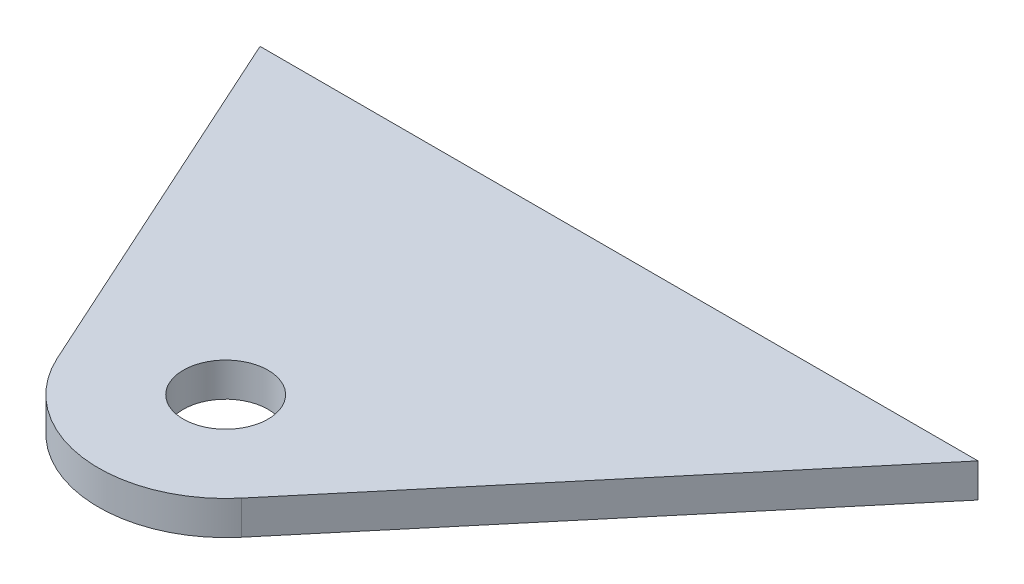
ISO-10303-21;
HEADER;
FILE_DESCRIPTION(('STEP AP214'),'2;1');
FILE_NAME('part.step','',(''),(''),'','','');
FILE_SCHEMA(('AUTOMOTIVE_DESIGN { 1 0 10303 214 1 1 1 1 }'));
ENDSEC;
DATA;
#1=APPLICATION_CONTEXT('core data for automotive mechanical design processes');
#2=APPLICATION_PROTOCOL_DEFINITION('international standard','automotive_design',2000,#1);
#3=PRODUCT_CONTEXT('',#1,'mechanical');
#4=PRODUCT('Part','Part','',(#3));
#5=PRODUCT_RELATED_PRODUCT_CATEGORY('part','',(#4));
#6=PRODUCT_DEFINITION_FORMATION('','',#4);
#7=PRODUCT_DEFINITION_CONTEXT('part definition',#1,'design');
#8=PRODUCT_DEFINITION('design','',#6,#7);
#9=PRODUCT_DEFINITION_SHAPE('','',#8);
#10=(LENGTH_UNIT() NAMED_UNIT(*) SI_UNIT(.MILLI.,.METRE.));
#11=(NAMED_UNIT(*) PLANE_ANGLE_UNIT() SI_UNIT($,.RADIAN.));
#12=(NAMED_UNIT(*) SI_UNIT($,.STERADIAN.) SOLID_ANGLE_UNIT());
#13=UNCERTAINTY_MEASURE_WITH_UNIT(LENGTH_MEASURE(1.E-05),#10,'distance_accuracy_value','');
#14=(GEOMETRIC_REPRESENTATION_CONTEXT(3) GLOBAL_UNCERTAINTY_ASSIGNED_CONTEXT((#13)) GLOBAL_UNIT_ASSIGNED_CONTEXT((#10,
#11,#12)) REPRESENTATION_CONTEXT('',''));
#15=CARTESIAN_POINT('',(0.,0.,0.));
#16=DIRECTION('',(0.,0.,1.));
#17=DIRECTION('',(1.,0.,0.));
#18=AXIS2_PLACEMENT_3D('',#15,#16,#17);
#19=CARTESIAN_POINT('',(-177.8,128.27,193.675));
#20=DIRECTION('',(0.,-1.,0.));
#21=DIRECTION('',(0.,0.,-1.));
#22=AXIS2_PLACEMENT_3D('',#19,#20,#21);
#23=PLANE('',#22);
#24=DIRECTION('',(1.,0.,0.));
#25=VECTOR('',#24,1.);
#26=CARTESIAN_POINT('',(-145.331652775121,128.27,169.799));
#27=LINE('',#26,#25);
#28=CARTESIAN_POINT('',(-199.103631179078,128.27,169.799));
#29=VERTEX_POINT('',#28);
#30=CARTESIAN_POINT('',(-145.331652775121,128.27,169.799));
#31=VERTEX_POINT('',#30);
#32=EDGE_CURVE('E86',#29,#31,#27,.T.);
#33=ORIENTED_EDGE('',*,*,#32,.T.);
#34=DIRECTION('',(-0.642787609686538,0.,0.76604444311898));
#35=VECTOR('',#34,1.);
#36=CARTESIAN_POINT('',(-145.331652775121,128.27,169.799));
#37=LINE('',#36,#35);
#38=CARTESIAN_POINT('',(-170.503426679292,128.27,199.797551982264));
#39=VERTEX_POINT('',#38);
#40=EDGE_CURVE('E81',#31,#39,#37,.T.);
#41=ORIENTED_EDGE('',*,*,#40,.T.);
#42=CARTESIAN_POINT('',(-177.8,128.27,193.675));
#43=DIRECTION('',(0.,-1.,0.));
#44=DIRECTION('',(0.,0.,-1.));
#45=AXIS2_PLACEMENT_3D('',#42,#43,#44);
#46=CIRCLE('',#45,9.52500000000001);
#47=CARTESIAN_POINT('',(-186.472639667224,128.27,197.613393860763));
#48=VERTEX_POINT('',#47);
#49=EDGE_CURVE('E84',#39,#48,#46,.T.);
#50=ORIENTED_EDGE('',*,*,#49,.T.);
#51=DIRECTION('',(-0.413479670421325,0.,-0.910513350889637));
#52=VECTOR('',#51,1.);
#53=CARTESIAN_POINT('',(-199.103631179078,128.27,169.799));
#54=LINE('',#53,#52);
#55=EDGE_CURVE('E51',#48,#29,#54,.T.);
#56=ORIENTED_EDGE('',*,*,#55,.T.);
#57=EDGE_LOOP('',(#33,#41,#50,#56));
#58=FACE_BOUND('',#57,.T.);
#59=CARTESIAN_POINT('',(-177.8,128.27,193.675));
#60=DIRECTION('',(0.,-1.,0.));
#61=DIRECTION('',(0.,0.,-1.));
#62=AXIS2_PLACEMENT_3D('',#59,#60,#61);
#63=CIRCLE('',#62,3.175);
#64=CARTESIAN_POINT('',(-177.8,128.27,190.5));
#65=VERTEX_POINT('',#64);
#66=EDGE_CURVE('E101',#65,#65,#63,.T.);
#67=ORIENTED_EDGE('',*,*,#66,.F.);
#68=EDGE_LOOP('',(#67));
#69=FACE_BOUND('',#68,.T.);
#70=ADVANCED_FACE('F34',(#58,#69),#23,.T.);
#71=CARTESIAN_POINT('',(-177.8,130.81,193.675));
#72=DIRECTION('',(0.,-1.,0.));
#73=DIRECTION('',(0.,0.,-1.));
#74=AXIS2_PLACEMENT_3D('',#71,#72,#73);
#75=PLANE('',#74);
#76=DIRECTION('',(1.,0.,0.));
#77=VECTOR('',#76,1.);
#78=CARTESIAN_POINT('',(-145.331652775121,130.81,169.799));
#79=LINE('',#78,#77);
#80=CARTESIAN_POINT('',(-199.103631179078,130.81,169.799));
#81=VERTEX_POINT('',#80);
#82=CARTESIAN_POINT('',(-145.331652775121,130.81,169.799));
#83=VERTEX_POINT('',#82);
#84=EDGE_CURVE('E98',#81,#83,#79,.T.);
#85=ORIENTED_EDGE('',*,*,#84,.F.);
#86=DIRECTION('',(-0.413479670421325,0.,-0.910513350889637));
#87=VECTOR('',#86,1.);
#88=CARTESIAN_POINT('',(-199.103631179078,130.81,169.799));
#89=LINE('',#88,#87);
#90=CARTESIAN_POINT('',(-186.472639667224,130.81,197.613393860763));
#91=VERTEX_POINT('',#90);
#92=EDGE_CURVE('E74',#91,#81,#89,.T.);
#93=ORIENTED_EDGE('',*,*,#92,.F.);
#94=CARTESIAN_POINT('',(-177.8,130.81,193.675));
#95=DIRECTION('',(0.,-1.,0.));
#96=DIRECTION('',(0.,0.,-1.));
#97=AXIS2_PLACEMENT_3D('',#94,#95,#96);
#98=CIRCLE('',#97,9.52500000000001);
#99=CARTESIAN_POINT('',(-170.503426679292,130.81,199.797551982264));
#100=VERTEX_POINT('',#99);
#101=EDGE_CURVE('E68',#100,#91,#98,.T.);
#102=ORIENTED_EDGE('',*,*,#101,.F.);
#103=DIRECTION('',(-0.642787609686538,0.,0.76604444311898));
#104=VECTOR('',#103,1.);
#105=CARTESIAN_POINT('',(-145.331652775121,130.81,169.799));
#106=LINE('',#105,#104);
#107=EDGE_CURVE('E90',#83,#100,#106,.T.);
#108=ORIENTED_EDGE('',*,*,#107,.F.);
#109=EDGE_LOOP('',(#85,#93,#102,#108));
#110=FACE_BOUND('',#109,.T.);
#111=CARTESIAN_POINT('',(-177.8,130.81,193.675));
#112=DIRECTION('',(0.,-1.,0.));
#113=DIRECTION('',(0.,0.,-1.));
#114=AXIS2_PLACEMENT_3D('',#111,#112,#113);
#115=CIRCLE('',#114,3.175);
#116=CARTESIAN_POINT('',(-177.8,130.81,190.5));
#117=VERTEX_POINT('',#116);
#118=EDGE_CURVE('E113',#117,#117,#115,.T.);
#119=ORIENTED_EDGE('',*,*,#118,.T.);
#120=EDGE_LOOP('',(#119));
#121=FACE_BOUND('',#120,.T.);
#122=ADVANCED_FACE('F109',(#110,#121),#75,.F.);
#123=CARTESIAN_POINT('',(-145.331652775121,128.27,169.799));
#124=DIRECTION('',(0.,0.,1.));
#125=DIRECTION('',(0.,-1.,0.));
#126=AXIS2_PLACEMENT_3D('',#123,#124,#125);
#127=PLANE('',#126);
#128=ORIENTED_EDGE('',*,*,#84,.T.);
#129=DIRECTION('',(0.,1.,0.));
#130=VECTOR('',#129,1.);
#131=CARTESIAN_POINT('',(-145.331652775121,128.27,169.799));
#132=LINE('',#131,#130);
#133=EDGE_CURVE('E11',#31,#83,#132,.T.);
#134=ORIENTED_EDGE('',*,*,#133,.F.);
#135=ORIENTED_EDGE('',*,*,#32,.F.);
#136=DIRECTION('',(0.,1.,0.));
#137=VECTOR('',#136,1.);
#138=CARTESIAN_POINT('',(-199.103631179078,128.27,169.799));
#139=LINE('',#138,#137);
#140=EDGE_CURVE('E94',#29,#81,#139,.T.);
#141=ORIENTED_EDGE('',*,*,#140,.T.);
#142=EDGE_LOOP('',(#128,#134,#135,#141));
#143=FACE_BOUND('',#142,.T.);
#144=ADVANCED_FACE('F36',(#143),#127,.F.);
#145=CARTESIAN_POINT('',(-145.331652775121,128.27,169.799));
#146=DIRECTION('',(-0.76604444311898,0.,-0.642787609686539));
#147=DIRECTION('',(-0.642787609686538,0.,0.76604444311898));
#148=AXIS2_PLACEMENT_3D('',#145,#146,#147);
#149=PLANE('',#148);
#150=ORIENTED_EDGE('',*,*,#107,.T.);
#151=DIRECTION('',(0.,1.,0.));
#152=VECTOR('',#151,1.);
#153=CARTESIAN_POINT('',(-170.503426679292,128.27,199.797551982264));
#154=LINE('',#153,#152);
#155=EDGE_CURVE('E43',#39,#100,#154,.T.);
#156=ORIENTED_EDGE('',*,*,#155,.F.);
#157=ORIENTED_EDGE('',*,*,#40,.F.);
#158=ORIENTED_EDGE('',*,*,#133,.T.);
#159=EDGE_LOOP('',(#150,#156,#157,#158));
#160=FACE_BOUND('',#159,.T.);
#161=ADVANCED_FACE('F89',(#160),#149,.F.);
#162=CARTESIAN_POINT('',(-177.8,128.27,193.675));
#163=DIRECTION('',(0.,1.,0.));
#164=DIRECTION('',(0.,0.,1.));
#165=AXIS2_PLACEMENT_3D('',#162,#163,#164);
#166=CYLINDRICAL_SURFACE('',#165,9.52500000000001);
#167=ORIENTED_EDGE('',*,*,#101,.T.);
#168=DIRECTION('',(0.,1.,0.));
#169=VECTOR('',#168,1.);
#170=CARTESIAN_POINT('',(-186.472639667224,128.27,197.613393860763));
#171=LINE('',#170,#169);
#172=EDGE_CURVE('E91',#48,#91,#171,.T.);
#173=ORIENTED_EDGE('',*,*,#172,.F.);
#174=ORIENTED_EDGE('',*,*,#49,.F.);
#175=ORIENTED_EDGE('',*,*,#155,.T.);
#176=EDGE_LOOP('',(#167,#173,#174,#175));
#177=FACE_BOUND('',#176,.T.);
#178=ADVANCED_FACE('F92',(#177),#166,.T.);
#179=CARTESIAN_POINT('',(-199.103631179078,128.27,169.799));
#180=DIRECTION('',(0.910513350889636,0.,-0.413479670421325));
#181=DIRECTION('',(-0.413479670421325,0.,-0.910513350889637));
#182=AXIS2_PLACEMENT_3D('',#179,#180,#181);
#183=PLANE('',#182);
#184=ORIENTED_EDGE('',*,*,#92,.T.);
#185=ORIENTED_EDGE('',*,*,#140,.F.);
#186=ORIENTED_EDGE('',*,*,#55,.F.);
#187=ORIENTED_EDGE('',*,*,#172,.T.);
#188=EDGE_LOOP('',(#184,#185,#186,#187));
#189=FACE_BOUND('',#188,.T.);
#190=ADVANCED_FACE('F106',(#189),#183,.F.);
#191=CARTESIAN_POINT('',(-177.8,128.27,193.675));
#192=DIRECTION('',(0.,1.,0.));
#193=DIRECTION('',(0.,0.,1.));
#194=AXIS2_PLACEMENT_3D('',#191,#192,#193);
#195=CYLINDRICAL_SURFACE('',#194,3.175);
#196=ORIENTED_EDGE('',*,*,#66,.T.);
#197=EDGE_LOOP('',(#196));
#198=FACE_BOUND('',#197,.T.);
#199=ORIENTED_EDGE('',*,*,#118,.F.);
#200=EDGE_LOOP('',(#199));
#201=FACE_BOUND('',#200,.T.);
#202=ADVANCED_FACE('F119',(#198,#201),#195,.F.);
#203=CLOSED_SHELL('',(#70,#122,#144,#161,#178,#190,#202));
#204=MANIFOLD_SOLID_BREP('B2',#203);
#205=ADVANCED_BREP_SHAPE_REPRESENTATION('',(#18,#204),#14);
#206=SHAPE_DEFINITION_REPRESENTATION(#9,#205);
ENDSEC;
END-ISO-10303-21;
